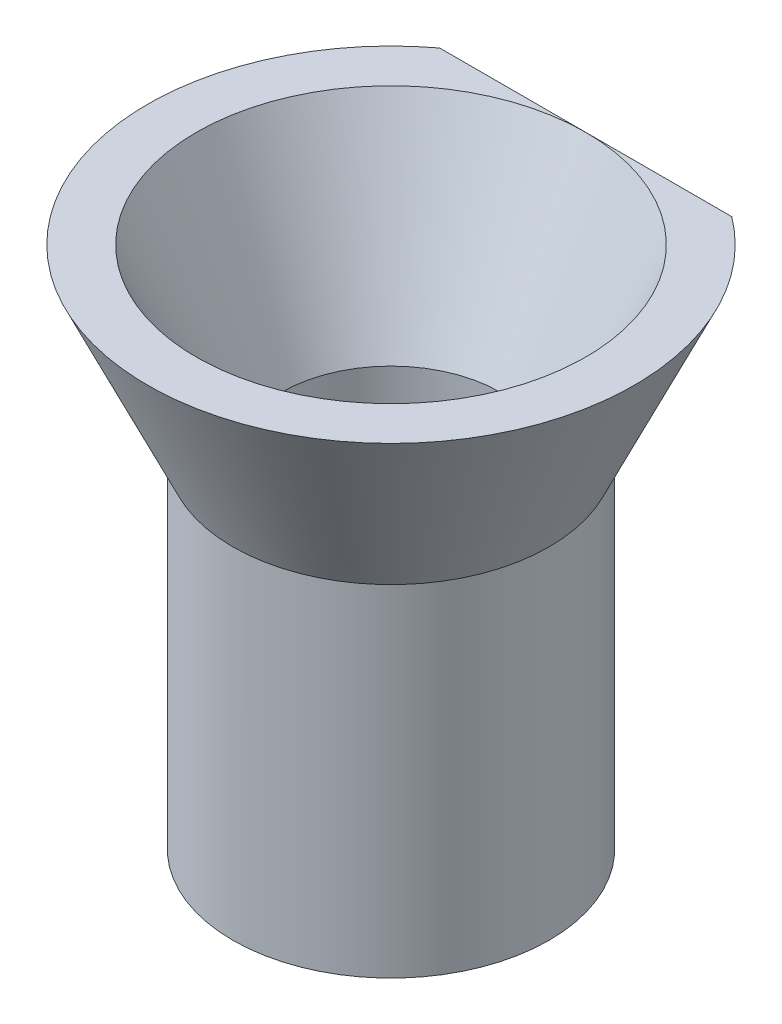
ISO-10303-21;
HEADER;
FILE_DESCRIPTION(('STEP AP214'),'2;1');
FILE_NAME('part.step','',(''),(''),'','','');
FILE_SCHEMA(('AUTOMOTIVE_DESIGN { 1 0 10303 214 1 1 1 1 }'));
ENDSEC;
DATA;
#1=APPLICATION_CONTEXT('core data for automotive mechanical design processes');
#2=APPLICATION_PROTOCOL_DEFINITION('international standard','automotive_design',2000,#1);
#3=PRODUCT_CONTEXT('',#1,'mechanical');
#4=PRODUCT('Part','Part','',(#3));
#5=PRODUCT_RELATED_PRODUCT_CATEGORY('part','',(#4));
#6=PRODUCT_DEFINITION_FORMATION('','',#4);
#7=PRODUCT_DEFINITION_CONTEXT('part definition',#1,'design');
#8=PRODUCT_DEFINITION('design','',#6,#7);
#9=PRODUCT_DEFINITION_SHAPE('','',#8);
#10=(LENGTH_UNIT() NAMED_UNIT(*) SI_UNIT(.MILLI.,.METRE.));
#11=(NAMED_UNIT(*) PLANE_ANGLE_UNIT() SI_UNIT($,.RADIAN.));
#12=(NAMED_UNIT(*) SI_UNIT($,.STERADIAN.) SOLID_ANGLE_UNIT());
#13=UNCERTAINTY_MEASURE_WITH_UNIT(LENGTH_MEASURE(1.E-05),#10,'distance_accuracy_value','');
#14=(GEOMETRIC_REPRESENTATION_CONTEXT(3) GLOBAL_UNCERTAINTY_ASSIGNED_CONTEXT((#13)) GLOBAL_UNIT_ASSIGNED_CONTEXT((#10,
#11,#12)) REPRESENTATION_CONTEXT('',''));
#15=CARTESIAN_POINT('',(0.,0.,0.));
#16=DIRECTION('',(0.,0.,1.));
#17=DIRECTION('',(1.,0.,0.));
#18=AXIS2_PLACEMENT_3D('',#15,#16,#17);
#19=CARTESIAN_POINT('',(0.,7.5,0.));
#20=DIRECTION('',(0.,1.,0.));
#21=DIRECTION('',(-1.,0.,0.));
#22=AXIS2_PLACEMENT_3D('',#19,#20,#21);
#23=CONICAL_SURFACE('',#22,10.,0.436627159813541);
#24=CARTESIAN_POINT('',(-19.2884097713952,30.8177929408071,-8.));
#25=CARTESIAN_POINT('',(-19.0577415632993,30.3612219447577,-8.));
#26=CARTESIAN_POINT('',(-18.8265937792047,29.9048933152325,-8.));
#27=CARTESIAN_POINT('',(-18.3632209374624,28.9927815728542,-8.));
#28=CARTESIAN_POINT('',(-18.1309958763986,28.5369984617367,-8.));
#29=CARTESIAN_POINT('',(-17.4321467817645,27.1698136247566,-8.));
#30=CARTESIAN_POINT('',(-16.9637279192824,26.2593277020454,-8.));
#31=CARTESIAN_POINT('',(-16.0105400294087,24.4215773153622,-8.));
#32=CARTESIAN_POINT('',(-15.5256375756263,23.4943819899245,-8.));
#33=CARTESIAN_POINT('',(-14.5480714874171,21.6450217362084,-8.));
#34=CARTESIAN_POINT('',(-14.0554143218022,20.7228533980256,-8.));
#35=CARTESIAN_POINT('',(-13.2161126741368,19.1739380006369,-8.));
#36=CARTESIAN_POINT('',(-12.8723540416844,18.5456283344557,-8.));
#37=CARTESIAN_POINT('',(-12.1784814721822,17.2925304300429,-8.));
#38=CARTESIAN_POINT('',(-11.8283676141053,16.6677421481793,-8.));
#39=CARTESIAN_POINT('',(-11.1190767758984,15.4209529321348,-8.));
#40=CARTESIAN_POINT('',(-10.7598767039314,14.7989651119324,-8.));
#41=CARTESIAN_POINT('',(-10.0310658976476,13.5612619240165,-8.));
#42=CARTESIAN_POINT('',(-9.66145739906652,12.9455452473703,-8.));
#43=CARTESIAN_POINT('',(-9.09922057926501,12.0328533810593,-8.));
#44=CARTESIAN_POINT('',(-8.91190796007525,11.7326030207427,-8.));
#45=CARTESIAN_POINT('',(-8.533272825053,11.1346444315125,-8.));
#46=CARTESIAN_POINT('',(-8.34195038789604,10.8369361528825,-8.));
#47=CARTESIAN_POINT('',(-7.95439526812932,10.2443346794606,-8.));
#48=CARTESIAN_POINT('',(-7.75815821900338,9.94944433466304,-8.));
#49=CARTESIAN_POINT('',(-7.36002807517243,9.36351322325857,-8.));
#50=CARTESIAN_POINT('',(-7.15813520992214,9.07247230118491,-8.));
#51=CARTESIAN_POINT('',(-6.74852980433223,8.49669870282909,-8.));
#52=CARTESIAN_POINT('',(-6.54085159661154,8.21194168053011,-8.));
#53=CARTESIAN_POINT('',(-6.11713632217694,7.64859695519637,-8.));
#54=CARTESIAN_POINT('',(-5.90109769336289,7.37001042052313,-8.));
#55=CARTESIAN_POINT('',(-5.45902494932611,6.8216004839004,-8.));
#56=CARTESIAN_POINT('',(-5.23300775348304,6.55176349951137,-8.));
#57=CARTESIAN_POINT('',(-4.76799062477663,6.02357526993105,-8.));
#58=CARTESIAN_POINT('',(-4.52899736477018,5.76521824324345,-8.));
#59=CARTESIAN_POINT('',(-4.2058093971072,5.4384488479626,-8.));
#60=CARTESIAN_POINT('',(-4.12917156851662,5.36253390299243,-8.));
#61=CARTESIAN_POINT('',(-3.97416552915966,5.21245696363709,-8.));
#62=CARTESIAN_POINT('',(-3.89579698938318,5.13829530819986,-8.));
#63=CARTESIAN_POINT('',(-3.73717064214727,4.99193724679744,-8.));
#64=CARTESIAN_POINT('',(-3.65691193387716,4.91974181473777,-8.));
#65=CARTESIAN_POINT('',(-3.4943992823337,4.77764214104632,-8.));
#66=CARTESIAN_POINT('',(-3.41214541487208,4.70773781259416,-8.));
#67=CARTESIAN_POINT('',(-3.16388463282925,4.50335517050395,-8.));
#68=CARTESIAN_POINT('',(-2.99472006487863,4.3726591293898,-8.));
#69=CARTESIAN_POINT('',(-2.64679448398491,4.12474589646534,-8.));
#70=CARTESIAN_POINT('',(-2.46803963359151,4.00752019747723,-8.));
#71=CARTESIAN_POINT('',(-2.18941239880785,3.84361985257281,-8.));
#72=CARTESIAN_POINT('',(-2.09342063195295,3.79034395076342,-8.));
#73=CARTESIAN_POINT('',(-1.8986223770057,3.68928702543783,-8.));
#74=CARTESIAN_POINT('',(-1.79981628404627,3.64150523524398,-8.));
#75=CARTESIAN_POINT('',(-1.49903836245752,3.50759492159434,-8.));
#76=CARTESIAN_POINT('',(-1.29264014020449,3.43086101048682,-8.));
#77=CARTESIAN_POINT('',(-0.969396615837802,3.33803068069627,-8.));
#78=CARTESIAN_POINT('',(-0.855798842062789,3.31035732879887,-8.));
#79=CARTESIAN_POINT('',(-0.626583853774897,3.26505090360045,-8.));
#80=CARTESIAN_POINT('',(-0.510966748906004,3.2474172869061,-8.));
#81=CARTESIAN_POINT('',(-0.278642644026156,3.22287984087777,-8.));
#82=CARTESIAN_POINT('',(-0.161936130096941,3.21597143659984,-8.));
#83=CARTESIAN_POINT('',(0.0716117012450015,3.21314631590765,-8.));
#84=CARTESIAN_POINT('',(0.188453018867904,3.21722961665391,-8.));
#85=CARTESIAN_POINT('',(0.421010233234319,3.23620637090712,-8.));
#86=CARTESIAN_POINT('',(0.536727935451875,3.25107782368783,-8.));
#87=CARTESIAN_POINT('',(0.766409434630955,3.29102218258468,-8.));
#88=CARTESIAN_POINT('',(0.880372340612086,3.31610010447735,-8.));
#89=CARTESIAN_POINT('',(1.21857445000311,3.40540722501738,-8.));
#90=CARTESIAN_POINT('',(1.43918169047513,3.48371488679302,-8.));
#91=CARTESIAN_POINT('',(1.82040507762577,3.6489815275353,-8.));
#92=CARTESIAN_POINT('',(1.98358841733415,3.73030152419458,-8.));
#93=CARTESIAN_POINT('',(2.30226455695518,3.90699914611416,-8.));
#94=CARTESIAN_POINT('',(2.45775211844992,4.00238617553084,-8.));
#95=CARTESIAN_POINT('',(2.76190719947765,4.2044983991499,-8.));
#96=CARTESIAN_POINT('',(2.910547498603,4.31126404870195,-8.));
#97=CARTESIAN_POINT('',(3.201098083136,4.53343857361737,-8.));
#98=CARTESIAN_POINT('',(3.34301030473095,4.64884493741799,-8.));
#99=CARTESIAN_POINT('',(3.70239585737202,4.95616160640438,-8.));
#100=CARTESIAN_POINT('',(3.91541225485372,5.15327077183534,-8.));
#101=CARTESIAN_POINT('',(4.32949947854931,5.55973930087673,-8.));
#102=CARTESIAN_POINT('',(4.53056257066505,5.76910642552878,-8.));
#103=CARTESIAN_POINT('',(4.92333064627388,6.19724439944085,-8.));
#104=CARTESIAN_POINT('',(5.11501394983002,6.41603502201742,-8.));
#105=CARTESIAN_POINT('',(5.49028531294232,6.86032398345142,-8.));
#106=CARTESIAN_POINT('',(5.67387525112437,7.08582074511706,-8.));
#107=CARTESIAN_POINT('',(6.03648494768608,7.54468646691184,-8.));
#108=CARTESIAN_POINT('',(6.21542740803497,7.7781162754767,-8.));
#109=CARTESIAN_POINT('',(6.56763998839094,8.2492211118836,-8.));
#110=CARTESIAN_POINT('',(6.74090982094217,8.48689635391922,-8.));
#111=CARTESIAN_POINT('',(7.08241197656722,8.96531710736853,-8.));
#112=CARTESIAN_POINT('',(7.25065115485796,9.20605773740477,-8.));
#113=CARTESIAN_POINT('',(7.58304839027666,9.69032038622773,-8.));
#114=CARTESIAN_POINT('',(7.74720660601507,9.93384229637881,-8.));
#115=CARTESIAN_POINT('',(8.10368401145228,10.4709066043076,-8.));
#116=CARTESIAN_POINT('',(8.29525442938898,10.7649455264428,-8.));
#117=CARTESIAN_POINT('',(8.67417543364481,11.3557329672925,-8.));
#118=CARTESIAN_POINT('',(8.86152591804373,11.6524815512083,-8.));
#119=CARTESIAN_POINT('',(9.41824200397205,12.5461290562173,-8.));
#120=CARTESIAN_POINT('',(9.78223619868682,13.1463748632108,-8.));
#121=CARTESIAN_POINT('',(10.4996766036067,14.353412618875,-8.));
#122=CARTESIAN_POINT('',(10.8531186938484,14.9602070016686,-8.));
#123=CARTESIAN_POINT('',(11.5517605525026,16.1785317255858,-8.));
#124=CARTESIAN_POINT('',(11.8969601362462,16.7900621724127,-8.));
#125=CARTESIAN_POINT('',(12.5816031401875,18.018088806048,-8.));
#126=CARTESIAN_POINT('',(12.9210322639384,18.6345929458121,-8.));
#127=CARTESIAN_POINT('',(13.5946378994772,19.8704694395608,-8.));
#128=CARTESIAN_POINT('',(13.9288143511028,20.4898418262921,-8.));
#129=CARTESIAN_POINT('',(14.592790375146,21.730732470648,-8.));
#130=CARTESIAN_POINT('',(14.9225909895438,22.3522501713373,-8.));
#131=CARTESIAN_POINT('',(15.5786281379133,23.5971636818926,-8.));
#132=CARTESIAN_POINT('',(15.9048646639945,24.2205594959126,-8.));
#133=CARTESIAN_POINT('',(16.8114288590283,25.9629874623818,-8.));
#134=CARTESIAN_POINT('',(17.3884675398636,27.0837306668186,-8.));
#135=CARTESIAN_POINT('',(18.5354431740328,29.3289380739974,-8.));
#136=CARTESIAN_POINT('',(19.1053796172854,30.4534025367431,-8.));
#137=CARTESIAN_POINT('',(20.237548927161,32.7007631411584,-8.));
#138=CARTESIAN_POINT('',(20.7998030348597,33.8236485887297,-8.));
#139=CARTESIAN_POINT('',(21.6399194763529,35.5095401268965,-8.));
#140=CARTESIAN_POINT('',(21.9194020344326,36.0717399446148,-8.));
#141=CARTESIAN_POINT('',(22.4773950420702,37.1966209452955,-8.));
#142=CARTESIAN_POINT('',(22.7559054928546,37.7593021276494,-8.));
#143=CARTESIAN_POINT('',(23.0339841372695,38.3221966896174,-8.));
#144=B_SPLINE_CURVE_WITH_KNOTS('',3,(#24,#25,#26,#27,#28,#29,#30,#31,#32,#33,#34,#35,#36,#37,
#38,#39,#40,#41,#42,#43,#44,#45,#46,#47,#48,#49,#50,#51,#52,#53,#54,#55,#56,#57,#58,#59,#60,#61,
#62,#63,#64,#65,#66,#67,#68,#69,#70,#71,#72,#73,#74,#75,#76,#77,#78,#79,#80,#81,#82,#83,#84,#85,
#86,#87,#88,#89,#90,#91,#92,#93,#94,#95,#96,#97,#98,#99,#100,#101,#102,#103,#104,#105,#106,#107,
#108,#109,#110,#111,#112,#113,#114,#115,#116,#117,#118,#119,#120,#121,#122,#123,#124,#125,#126,
#127,#128,#129,#130,#131,#132,#133,#134,#135,#136,#137,#138,#139,#140,#141,#142,#143),
.UNSPECIFIED.,.F.,.F.,(4,2,2,2,2,2,2,2,2,2,2,2,2,2,2,2,2,2,2,2,2,2,2,2,2,2,2,2,2,2,2,2,2,2,2,2,
2,2,2,2,2,2,2,2,2,2,2,2,2,2,2,2,2,2,2,2,2,2,2,4),(0.,1.53459514469603,3.06919515892073,
6.14091973725429,9.27990317244001,12.4163939844671,14.5649677176228,16.7135147698731,
18.8682173502274,21.0224605774607,22.0840979587019,23.1457145293141,24.2083103553328,
25.2708631344192,26.3280778271794,27.3854910177482,28.4411754128904,29.496321978337,
29.8199172278544,30.1435745319234,30.4673893363983,30.791191855827,31.432001652757,
32.0724044965548,32.4015964332442,32.730742376841,33.3888014648013,33.7391931364762,
34.0895658416547,34.4397890508347,34.7900128067921,35.1395243375955,35.4892078370384,
36.1884123424794,36.7346762470083,37.2813070118841,37.8299505432268,38.378435217006,
39.2483539929892,40.1188296366743,40.991230433572,41.8634276515723,42.7457008357267,
43.6280186593814,44.5090736227754,45.3900942894287,46.4428659570103,47.4956630240158,
49.6014540351225,51.7080567551843,53.8147066283718,55.9259801598943,58.0372778556182,
60.1480634421519,62.2588537009129,66.0405275080847,69.8224713669315,73.5898202478583,
75.4733301624766,77.3568376997445),.UNSPECIFIED.);
#145=CARTESIAN_POINT('',(6.,7.5,-8.));
#146=VERTEX_POINT('',#145);
#147=CARTESIAN_POINT('',(-6.,7.5,-8.));
#148=VERTEX_POINT('',#147);
#149=EDGE_CURVE('E51',#146,#148,#144,.F.);
#150=ORIENTED_EDGE('',*,*,#149,.F.);
#151=CARTESIAN_POINT('',(0.,7.5,0.));
#152=DIRECTION('',(0.,1.,0.));
#153=DIRECTION('',(-1.,0.,0.));
#154=AXIS2_PLACEMENT_3D('',#151,#152,#153);
#155=CIRCLE('',#154,10.);
#156=EDGE_CURVE('E61',#148,#146,#155,.T.);
#157=ORIENTED_EDGE('',*,*,#156,.F.);
#158=EDGE_LOOP('',(#150,#157));
#159=FACE_BOUND('',#158,.T.);
#160=CARTESIAN_POINT('',(0.,0.,0.));
#161=DIRECTION('',(0.,-1.,0.));
#162=DIRECTION('',(1.,0.,0.));
#163=AXIS2_PLACEMENT_3D('',#160,#161,#162);
#164=CIRCLE('',#163,6.5);
#165=CARTESIAN_POINT('',(6.5,0.,0.));
#166=VERTEX_POINT('',#165);
#167=EDGE_CURVE('E70',#166,#166,#164,.T.);
#168=ORIENTED_EDGE('',*,*,#167,.F.);
#169=EDGE_LOOP('',(#168));
#170=FACE_BOUND('',#169,.T.);
#171=ADVANCED_FACE('F33',(#159,#170),#23,.T.);
#172=CARTESIAN_POINT('',(0.,0.,0.));
#173=DIRECTION('',(0.,1.,0.));
#174=DIRECTION('',(-1.,0.,0.));
#175=AXIS2_PLACEMENT_3D('',#172,#173,#174);
#176=CONICAL_SURFACE('',#175,4.5,0.436627159813541);
#177=CARTESIAN_POINT('',(0.,7.5,0.));
#178=DIRECTION('',(0.,1.,0.));
#179=DIRECTION('',(-1.,0.,0.));
#180=AXIS2_PLACEMENT_3D('',#177,#178,#179);
#181=CIRCLE('',#180,8.);
#182=CARTESIAN_POINT('',(0.,7.5,-8.));
#183=VERTEX_POINT('',#182);
#184=EDGE_CURVE('E63',#183,#183,#181,.T.);
#185=ORIENTED_EDGE('',*,*,#184,.T.);
#186=EDGE_LOOP('',(#185));
#187=FACE_BOUND('',#186,.T.);
#188=CARTESIAN_POINT('',(0.,0.,0.));
#189=DIRECTION('',(0.,1.,0.));
#190=DIRECTION('',(-1.,0.,0.));
#191=AXIS2_PLACEMENT_3D('',#188,#189,#190);
#192=CIRCLE('',#191,4.5);
#193=CARTESIAN_POINT('',(-4.5,0.,0.));
#194=VERTEX_POINT('',#193);
#195=EDGE_CURVE('E67',#194,#194,#192,.T.);
#196=ORIENTED_EDGE('',*,*,#195,.F.);
#197=EDGE_LOOP('',(#196));
#198=FACE_BOUND('',#197,.T.);
#199=ADVANCED_FACE('F78',(#187,#198),#176,.F.);
#200=CARTESIAN_POINT('',(-8.,7.5,0.));
#201=DIRECTION('',(0.,1.,0.));
#202=DIRECTION('',(-1.,0.,0.));
#203=AXIS2_PLACEMENT_3D('',#200,#201,#202);
#204=PLANE('',#203);
#205=DIRECTION('',(1.,0.,0.));
#206=VECTOR('',#205,1.);
#207=CARTESIAN_POINT('',(-8.,7.5,-8.));
#208=LINE('',#207,#206);
#209=EDGE_CURVE('E11',#148,#183,#208,.T.);
#210=ORIENTED_EDGE('',*,*,#209,.F.);
#211=ORIENTED_EDGE('',*,*,#156,.T.);
#212=EDGE_CURVE('E37',#183,#146,#208,.T.);
#213=ORIENTED_EDGE('',*,*,#212,.F.);
#214=ORIENTED_EDGE('',*,*,#184,.F.);
#215=EDGE_LOOP('',(#210,#211,#213,#214));
#216=FACE_BOUND('',#215,.T.);
#217=ADVANCED_FACE('F60',(#216),#204,.T.);
#218=CARTESIAN_POINT('',(0.,-14.,0.));
#219=DIRECTION('',(0.,-1.,0.));
#220=DIRECTION('',(1.,0.,0.));
#221=AXIS2_PLACEMENT_3D('',#218,#219,#220);
#222=PLANE('',#221);
#223=CARTESIAN_POINT('',(0.,-14.,0.));
#224=DIRECTION('',(0.,-1.,0.));
#225=DIRECTION('',(1.,0.,0.));
#226=AXIS2_PLACEMENT_3D('',#223,#224,#225);
#227=CIRCLE('',#226,6.5);
#228=CARTESIAN_POINT('',(6.5,-14.,0.));
#229=VERTEX_POINT('',#228);
#230=EDGE_CURVE('E65',#229,#229,#227,.T.);
#231=ORIENTED_EDGE('',*,*,#230,.T.);
#232=EDGE_LOOP('',(#231));
#233=FACE_BOUND('',#232,.T.);
#234=CARTESIAN_POINT('',(0.,-14.,0.));
#235=DIRECTION('',(0.,-1.,0.));
#236=DIRECTION('',(1.,0.,0.));
#237=AXIS2_PLACEMENT_3D('',#234,#235,#236);
#238=CIRCLE('',#237,4.5);
#239=CARTESIAN_POINT('',(4.5,-14.,0.));
#240=VERTEX_POINT('',#239);
#241=EDGE_CURVE('E56',#240,#240,#238,.T.);
#242=ORIENTED_EDGE('',*,*,#241,.F.);
#243=EDGE_LOOP('',(#242));
#244=FACE_BOUND('',#243,.T.);
#245=ADVANCED_FACE('F85',(#233,#244),#222,.T.);
#246=CARTESIAN_POINT('',(0.,-14.,0.));
#247=DIRECTION('',(0.,1.,0.));
#248=DIRECTION('',(-1.,0.,0.));
#249=AXIS2_PLACEMENT_3D('',#246,#247,#248);
#250=CYLINDRICAL_SURFACE('',#249,6.5);
#251=ORIENTED_EDGE('',*,*,#230,.F.);
#252=EDGE_LOOP('',(#251));
#253=FACE_BOUND('',#252,.T.);
#254=ORIENTED_EDGE('',*,*,#167,.T.);
#255=EDGE_LOOP('',(#254));
#256=FACE_BOUND('',#255,.T.);
#257=ADVANCED_FACE('F88',(#253,#256),#250,.T.);
#258=CARTESIAN_POINT('',(0.,-14.,0.));
#259=DIRECTION('',(0.,1.,0.));
#260=DIRECTION('',(-1.,0.,0.));
#261=AXIS2_PLACEMENT_3D('',#258,#259,#260);
#262=CYLINDRICAL_SURFACE('',#261,4.5);
#263=ORIENTED_EDGE('',*,*,#241,.T.);
#264=EDGE_LOOP('',(#263));
#265=FACE_BOUND('',#264,.T.);
#266=ORIENTED_EDGE('',*,*,#195,.T.);
#267=EDGE_LOOP('',(#266));
#268=FACE_BOUND('',#267,.T.);
#269=ADVANCED_FACE('F76',(#265,#268),#262,.F.);
#270=CARTESIAN_POINT('',(-7.11234895779441,0.,-8.));
#271=DIRECTION('',(0.,0.,1.));
#272=DIRECTION('',(1.,0.,0.));
#273=AXIS2_PLACEMENT_3D('',#270,#271,#272);
#274=PLANE('',#273);
#275=ORIENTED_EDGE('',*,*,#149,.T.);
#276=ORIENTED_EDGE('',*,*,#209,.T.);
#277=ORIENTED_EDGE('',*,*,#212,.T.);
#278=EDGE_LOOP('',(#275,#276,#277));
#279=FACE_BOUND('',#278,.T.);
#280=ADVANCED_FACE('F52',(#279),#274,.F.);
#281=CLOSED_SHELL('',(#171,#199,#217,#245,#257,#269,#280));
#282=MANIFOLD_SOLID_BREP('B2',#281);
#283=ADVANCED_BREP_SHAPE_REPRESENTATION('',(#18,#282),#14);
#284=SHAPE_DEFINITION_REPRESENTATION(#9,#283);
ENDSEC;
END-ISO-10303-21;
